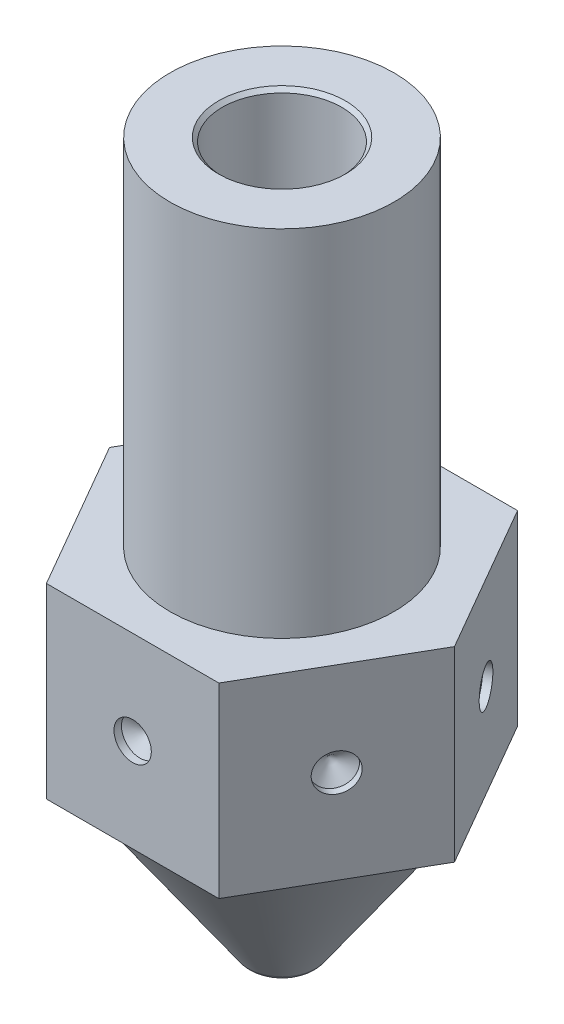
ISO-10303-21;
HEADER;
FILE_DESCRIPTION(('STEP AP214'),'2;1');
FILE_NAME('part.step','',(''),(''),'','','');
FILE_SCHEMA(('AUTOMOTIVE_DESIGN { 1 0 10303 214 1 1 1 1 }'));
ENDSEC;
DATA;
#1=APPLICATION_CONTEXT('core data for automotive mechanical design processes');
#2=APPLICATION_PROTOCOL_DEFINITION('international standard','automotive_design',2000,#1);
#3=PRODUCT_CONTEXT('',#1,'mechanical');
#4=PRODUCT('Part','Part','',(#3));
#5=PRODUCT_RELATED_PRODUCT_CATEGORY('part','',(#4));
#6=PRODUCT_DEFINITION_FORMATION('','',#4);
#7=PRODUCT_DEFINITION_CONTEXT('part definition',#1,'design');
#8=PRODUCT_DEFINITION('design','',#6,#7);
#9=PRODUCT_DEFINITION_SHAPE('','',#8);
#10=(LENGTH_UNIT() NAMED_UNIT(*) SI_UNIT(.MILLI.,.METRE.));
#11=(NAMED_UNIT(*) PLANE_ANGLE_UNIT() SI_UNIT($,.RADIAN.));
#12=(NAMED_UNIT(*) SI_UNIT($,.STERADIAN.) SOLID_ANGLE_UNIT());
#13=UNCERTAINTY_MEASURE_WITH_UNIT(LENGTH_MEASURE(1.E-05),#10,'distance_accuracy_value','');
#14=(GEOMETRIC_REPRESENTATION_CONTEXT(3) GLOBAL_UNCERTAINTY_ASSIGNED_CONTEXT((#13)) GLOBAL_UNIT_ASSIGNED_CONTEXT((#10,
#11,#12)) REPRESENTATION_CONTEXT('',''));
#15=CARTESIAN_POINT('',(0.,0.,0.));
#16=DIRECTION('',(0.,0.,1.));
#17=DIRECTION('',(1.,0.,0.));
#18=AXIS2_PLACEMENT_3D('',#15,#16,#17);
#19=CARTESIAN_POINT('',(3.9341607421644,4.5,0.));
#20=DIRECTION('',(0.,-1.,0.));
#21=DIRECTION('',(0.,0.,-1.));
#22=AXIS2_PLACEMENT_3D('',#19,#20,#21);
#23=PLANE('',#22);
#24=CARTESIAN_POINT('',(0.,4.5,0.));
#25=DIRECTION('',(0.,-1.,0.));
#26=DIRECTION('',(0.,0.,-1.));
#27=AXIS2_PLACEMENT_3D('',#24,#25,#26);
#28=CIRCLE('',#27,3.9341607421644);
#29=CARTESIAN_POINT('',(0.,4.5,-3.9341607421644));
#30=VERTEX_POINT('',#29);
#31=EDGE_CURVE('E228',#30,#30,#28,.T.);
#32=ORIENTED_EDGE('',*,*,#31,.F.);
#33=EDGE_LOOP('',(#32));
#34=FACE_BOUND('',#33,.T.);
#35=DIRECTION('',(1.,0.,0.));
#36=VECTOR('',#35,1.);
#37=CARTESIAN_POINT('',(3.9341607421644,4.5,-4.));
#38=LINE('',#37,#36);
#39=CARTESIAN_POINT('',(-2.3094010767585,4.5,-4.));
#40=VERTEX_POINT('',#39);
#41=CARTESIAN_POINT('',(2.3094010767585,4.5,-4.));
#42=VERTEX_POINT('',#41);
#43=EDGE_CURVE('E173',#40,#42,#38,.T.);
#44=ORIENTED_EDGE('',*,*,#43,.T.);
#45=DIRECTION('',(0.5,0.,0.866025403784438));
#46=VECTOR('',#45,1.);
#47=CARTESIAN_POINT('',(4.44764180067886,4.5,-0.296458427357094));
#48=LINE('',#47,#46);
#49=CARTESIAN_POINT('',(4.61880215351701,4.5,0.));
#50=VERTEX_POINT('',#49);
#51=EDGE_CURVE('E208',#42,#50,#48,.T.);
#52=ORIENTED_EDGE('',*,*,#51,.T.);
#53=DIRECTION('',(-0.5,0.,0.866025403784439));
#54=VECTOR('',#53,1.);
#55=CARTESIAN_POINT('',(4.44764180067886,4.5,0.296458427357093));
#56=LINE('',#55,#54);
#57=CARTESIAN_POINT('',(2.30940107675851,4.5,4.));
#58=VERTEX_POINT('',#57);
#59=EDGE_CURVE('E204',#50,#58,#56,.T.);
#60=ORIENTED_EDGE('',*,*,#59,.T.);
#61=DIRECTION('',(-1.,0.,0.));
#62=VECTOR('',#61,1.);
#63=CARTESIAN_POINT('',(3.9341607421644,4.5,4.));
#64=LINE('',#63,#62);
#65=CARTESIAN_POINT('',(-2.3094010767585,4.5,4.));
#66=VERTEX_POINT('',#65);
#67=EDGE_CURVE('E200',#58,#66,#64,.T.);
#68=ORIENTED_EDGE('',*,*,#67,.T.);
#69=DIRECTION('',(-0.500000000000001,0.,-0.866025403784438));
#70=VECTOR('',#69,1.);
#71=CARTESIAN_POINT('',(-2.48056142959665,4.5,3.70354157264291));
#72=LINE('',#71,#70);
#73=CARTESIAN_POINT('',(-4.61880215351701,4.5,0.));
#74=VERTEX_POINT('',#73);
#75=EDGE_CURVE('E196',#66,#74,#72,.T.);
#76=ORIENTED_EDGE('',*,*,#75,.T.);
#77=DIRECTION('',(0.5,0.,-0.866025403784439));
#78=VECTOR('',#77,1.);
#79=CARTESIAN_POINT('',(-2.48056142959665,4.5,-3.70354157264291));
#80=LINE('',#79,#78);
#81=EDGE_CURVE('E193',#74,#40,#80,.T.);
#82=ORIENTED_EDGE('',*,*,#81,.T.);
#83=EDGE_LOOP('',(#44,#52,#60,#68,#76,#82));
#84=FACE_BOUND('',#83,.T.);
#85=ADVANCED_FACE('F41',(#34,#84),#23,.T.);
#86=CARTESIAN_POINT('',(7.43519843321296,9.5,0.));
#87=DIRECTION('',(0.,1.,0.));
#88=DIRECTION('',(0.,0.,1.));
#89=AXIS2_PLACEMENT_3D('',#86,#87,#88);
#90=PLANE('',#89);
#91=CARTESIAN_POINT('',(0.,9.5,0.));
#92=DIRECTION('',(0.,-1.,0.));
#93=DIRECTION('',(0.,0.,-1.));
#94=AXIS2_PLACEMENT_3D('',#91,#92,#93);
#95=CIRCLE('',#94,3.);
#96=CARTESIAN_POINT('',(0.,9.5,-3.));
#97=VERTEX_POINT('',#96);
#98=EDGE_CURVE('E224',#97,#97,#95,.T.);
#99=ORIENTED_EDGE('',*,*,#98,.T.);
#100=EDGE_LOOP('',(#99));
#101=FACE_BOUND('',#100,.T.);
#102=DIRECTION('',(0.5,0.,-0.866025403784439));
#103=VECTOR('',#102,1.);
#104=CARTESIAN_POINT('',(5.32290122344099,9.5,-1.21953536267034));
#105=LINE('',#104,#103);
#106=CARTESIAN_POINT('',(2.30940107675851,9.5,4.));
#107=VERTEX_POINT('',#106);
#108=CARTESIAN_POINT('',(4.61880215351701,9.5,0.));
#109=VERTEX_POINT('',#108);
#110=EDGE_CURVE('E259',#107,#109,#105,.T.);
#111=ORIENTED_EDGE('',*,*,#110,.T.);
#112=DIRECTION('',(-0.5,0.,-0.866025403784438));
#113=VECTOR('',#112,1.);
#114=CARTESIAN_POINT('',(5.322901223441,9.5,1.21953536267034));
#115=LINE('',#114,#113);
#116=CARTESIAN_POINT('',(2.3094010767585,9.5,-4.));
#117=VERTEX_POINT('',#116);
#118=EDGE_CURVE('E263',#109,#117,#115,.T.);
#119=ORIENTED_EDGE('',*,*,#118,.T.);
#120=DIRECTION('',(-1.,0.,0.));
#121=VECTOR('',#120,1.);
#122=CARTESIAN_POINT('',(7.43519843321296,9.5,-4.));
#123=LINE('',#122,#121);
#124=CARTESIAN_POINT('',(-2.3094010767585,9.5,-4.));
#125=VERTEX_POINT('',#124);
#126=EDGE_CURVE('E243',#117,#125,#123,.T.);
#127=ORIENTED_EDGE('',*,*,#126,.T.);
#128=DIRECTION('',(-0.5,0.,0.866025403784439));
#129=VECTOR('',#128,1.);
#130=CARTESIAN_POINT('',(-1.60530200683451,9.5,-5.21953536267034));
#131=LINE('',#130,#129);
#132=CARTESIAN_POINT('',(-4.61880215351701,9.5,0.));
#133=VERTEX_POINT('',#132);
#134=EDGE_CURVE('E247',#125,#133,#131,.T.);
#135=ORIENTED_EDGE('',*,*,#134,.T.);
#136=DIRECTION('',(0.500000000000001,0.,0.866025403784438));
#137=VECTOR('',#136,1.);
#138=CARTESIAN_POINT('',(-1.60530200683451,9.5,5.21953536267035));
#139=LINE('',#138,#137);
#140=CARTESIAN_POINT('',(-2.3094010767585,9.5,4.));
#141=VERTEX_POINT('',#140);
#142=EDGE_CURVE('E251',#133,#141,#139,.T.);
#143=ORIENTED_EDGE('',*,*,#142,.T.);
#144=DIRECTION('',(1.,0.,0.));
#145=VECTOR('',#144,1.);
#146=CARTESIAN_POINT('',(7.43519843321297,9.5,4.));
#147=LINE('',#146,#145);
#148=EDGE_CURVE('E255',#141,#107,#147,.T.);
#149=ORIENTED_EDGE('',*,*,#148,.T.);
#150=EDGE_LOOP('',(#111,#119,#127,#135,#143,#149));
#151=FACE_BOUND('',#150,.T.);
#152=ADVANCED_FACE('F289',(#101,#151),#90,.T.);
#153=CARTESIAN_POINT('',(0.,0.,0.));
#154=DIRECTION('',(0.,-1.,0.));
#155=DIRECTION('',(0.,0.,-1.));
#156=AXIS2_PLACEMENT_3D('',#153,#154,#155);
#157=CYLINDRICAL_SURFACE('',#156,0.5);
#158=CARTESIAN_POINT('',(0.,0.,0.));
#159=DIRECTION('',(0.,-1.,0.));
#160=DIRECTION('',(0.,0.,-1.));
#161=AXIS2_PLACEMENT_3D('',#158,#159,#160);
#162=CIRCLE('',#161,0.5);
#163=CARTESIAN_POINT('',(0.,0.,-0.5));
#164=VERTEX_POINT('',#163);
#165=EDGE_CURVE('E239',#164,#164,#162,.T.);
#166=ORIENTED_EDGE('',*,*,#165,.T.);
#167=EDGE_LOOP('',(#166));
#168=FACE_BOUND('',#167,.T.);
#169=CARTESIAN_POINT('',(0.,2.,0.));
#170=DIRECTION('',(0.,-1.,0.));
#171=DIRECTION('',(0.,0.,-1.));
#172=AXIS2_PLACEMENT_3D('',#169,#170,#171);
#173=CIRCLE('',#172,0.5);
#174=CARTESIAN_POINT('',(0.,2.,-0.5));
#175=VERTEX_POINT('',#174);
#176=EDGE_CURVE('E212',#175,#175,#173,.T.);
#177=ORIENTED_EDGE('',*,*,#176,.F.);
#178=EDGE_LOOP('',(#177));
#179=FACE_BOUND('',#178,.T.);
#180=ADVANCED_FACE('F295',(#168,#179),#157,.F.);
#181=CARTESIAN_POINT('',(0.5,0.,0.));
#182=DIRECTION('',(0.,-1.,0.));
#183=DIRECTION('',(0.,0.,-1.));
#184=AXIS2_PLACEMENT_3D('',#181,#182,#183);
#185=PLANE('',#184);
#186=CARTESIAN_POINT('',(0.,0.,0.));
#187=DIRECTION('',(0.,-1.,0.));
#188=DIRECTION('',(0.,0.,-1.));
#189=AXIS2_PLACEMENT_3D('',#186,#187,#188);
#190=CIRCLE('',#189,0.575);
#191=CARTESIAN_POINT('',(0.,0.,-0.575));
#192=VERTEX_POINT('',#191);
#193=EDGE_CURVE('E235',#192,#192,#190,.T.);
#194=ORIENTED_EDGE('',*,*,#193,.T.);
#195=EDGE_LOOP('',(#194));
#196=FACE_BOUND('',#195,.T.);
#197=ORIENTED_EDGE('',*,*,#165,.F.);
#198=EDGE_LOOP('',(#197));
#199=FACE_BOUND('',#198,.T.);
#200=ADVANCED_FACE('F310',(#196,#199),#185,.T.);
#201=CARTESIAN_POINT('',(0.,0.4,0.));
#202=DIRECTION('',(0.,-1.,0.));
#203=DIRECTION('',(0.,0.,-1.));
#204=AXIS2_PLACEMENT_3D('',#201,#202,#203);
#205=TOROIDAL_SURFACE('',#204,0.575,0.4);
#206=CARTESIAN_POINT('',(0.,0.170569425459581,0.));
#207=DIRECTION('',(0.,-1.,0.));
#208=DIRECTION('',(0.,0.,-1.));
#209=AXIS2_PLACEMENT_3D('',#206,#207,#208);
#210=CIRCLE('',#209,0.902660817715596);
#211=CARTESIAN_POINT('',(0.,0.170569425459581,-0.902660817715596));
#212=VERTEX_POINT('',#211);
#213=EDGE_CURVE('E231',#212,#212,#210,.T.);
#214=ORIENTED_EDGE('',*,*,#213,.T.);
#215=EDGE_LOOP('',(#214));
#216=FACE_BOUND('',#215,.T.);
#217=ORIENTED_EDGE('',*,*,#193,.F.);
#218=EDGE_LOOP('',(#217));
#219=FACE_BOUND('',#218,.T.);
#220=ADVANCED_FACE('F306',(#216,#219),#205,.T.);
#221=CARTESIAN_POINT('',(0.,0.170569425459581,0.));
#222=DIRECTION('',(0.,1.,0.));
#223=DIRECTION('',(0.,0.,1.));
#224=AXIS2_PLACEMENT_3D('',#221,#222,#223);
#225=CONICAL_SURFACE('',#224,0.902660817715596,0.610865238198017);
#226=ORIENTED_EDGE('',*,*,#31,.T.);
#227=EDGE_LOOP('',(#226));
#228=FACE_BOUND('',#227,.T.);
#229=ORIENTED_EDGE('',*,*,#213,.F.);
#230=EDGE_LOOP('',(#229));
#231=FACE_BOUND('',#230,.T.);
#232=ADVANCED_FACE('F302',(#228,#231),#225,.T.);
#233=CARTESIAN_POINT('',(0.,0.,0.));
#234=DIRECTION('',(0.,-1.,0.));
#235=DIRECTION('',(0.,0.,-1.));
#236=AXIS2_PLACEMENT_3D('',#233,#234,#235);
#237=CYLINDRICAL_SURFACE('',#236,3.);
#238=CARTESIAN_POINT('',(0.,19.,0.));
#239=DIRECTION('',(0.,-1.,0.));
#240=DIRECTION('',(0.,0.,-1.));
#241=AXIS2_PLACEMENT_3D('',#238,#239,#240);
#242=CIRCLE('',#241,3.);
#243=CARTESIAN_POINT('',(0.,19.,-3.));
#244=VERTEX_POINT('',#243);
#245=EDGE_CURVE('E220',#244,#244,#242,.T.);
#246=ORIENTED_EDGE('',*,*,#245,.T.);
#247=EDGE_LOOP('',(#246));
#248=FACE_BOUND('',#247,.T.);
#249=ORIENTED_EDGE('',*,*,#98,.F.);
#250=EDGE_LOOP('',(#249));
#251=FACE_BOUND('',#250,.T.);
#252=ADVANCED_FACE('F305',(#248,#251),#237,.T.);
#253=CARTESIAN_POINT('',(3.,19.,0.));
#254=DIRECTION('',(0.,1.,0.));
#255=DIRECTION('',(0.,0.,1.));
#256=AXIS2_PLACEMENT_3D('',#253,#254,#255);
#257=PLANE('',#256);
#258=CARTESIAN_POINT('',(0.,19.,0.));
#259=DIRECTION('',(0.,1.,0.));
#260=DIRECTION('',(0.,0.,1.));
#261=AXIS2_PLACEMENT_3D('',#258,#259,#260);
#262=CIRCLE('',#261,1.7);
#263=CARTESIAN_POINT('',(0.,19.,1.7));
#264=VERTEX_POINT('',#263);
#265=EDGE_CURVE('E50',#264,#264,#262,.F.);
#266=ORIENTED_EDGE('',*,*,#265,.T.);
#267=EDGE_LOOP('',(#266));
#268=FACE_BOUND('',#267,.T.);
#269=ORIENTED_EDGE('',*,*,#245,.F.);
#270=EDGE_LOOP('',(#269));
#271=FACE_BOUND('',#270,.T.);
#272=ADVANCED_FACE('F270',(#268,#271),#257,.T.);
#273=CARTESIAN_POINT('',(0.,0.,0.));
#274=DIRECTION('',(0.,-1.,0.));
#275=DIRECTION('',(0.,0.,-1.));
#276=AXIS2_PLACEMENT_3D('',#273,#274,#275);
#277=CYLINDRICAL_SURFACE('',#276,1.6);
#278=CARTESIAN_POINT('',(0.,18.9,0.));
#279=DIRECTION('',(0.,1.,0.));
#280=DIRECTION('',(0.,0.,1.));
#281=AXIS2_PLACEMENT_3D('',#278,#279,#280);
#282=CIRCLE('',#281,1.6);
#283=CARTESIAN_POINT('',(0.,18.9,1.6));
#284=VERTEX_POINT('',#283);
#285=EDGE_CURVE('E12',#284,#284,#282,.T.);
#286=ORIENTED_EDGE('',*,*,#285,.T.);
#287=EDGE_LOOP('',(#286));
#288=FACE_BOUND('',#287,.T.);
#289=CARTESIAN_POINT('',(0.,3.57096280741632,0.));
#290=DIRECTION('',(0.,-1.,0.));
#291=DIRECTION('',(0.,0.,-1.));
#292=AXIS2_PLACEMENT_3D('',#289,#290,#291);
#293=CIRCLE('',#292,1.6);
#294=CARTESIAN_POINT('',(0.,3.57096280741632,-1.6));
#295=VERTEX_POINT('',#294);
#296=EDGE_CURVE('E216',#295,#295,#293,.T.);
#297=ORIENTED_EDGE('',*,*,#296,.T.);
#298=EDGE_LOOP('',(#297));
#299=FACE_BOUND('',#298,.T.);
#300=ADVANCED_FACE('F326',(#288,#299),#277,.F.);
#301=CARTESIAN_POINT('',(0.,3.57096280741632,0.));
#302=DIRECTION('',(0.,1.,0.));
#303=DIRECTION('',(0.,0.,1.));
#304=AXIS2_PLACEMENT_3D('',#301,#302,#303);
#305=CONICAL_SURFACE('',#304,1.6,0.610865238198017);
#306=ORIENTED_EDGE('',*,*,#176,.T.);
#307=EDGE_LOOP('',(#306));
#308=FACE_BOUND('',#307,.T.);
#309=ORIENTED_EDGE('',*,*,#296,.F.);
#310=EDGE_LOOP('',(#309));
#311=FACE_BOUND('',#310,.T.);
#312=ADVANCED_FACE('F322',(#308,#311),#305,.F.);
#313=CARTESIAN_POINT('',(4.61880215351701,3.5,0.));
#314=DIRECTION('',(0.866025403784438,0.,-0.5));
#315=DIRECTION('',(-0.5,0.,-0.866025403784438));
#316=AXIS2_PLACEMENT_3D('',#313,#314,#315);
#317=PLANE('',#316);
#318=CARTESIAN_POINT('',(3.46410161513776,7.,-2.));
#319=DIRECTION('',(0.866025403784438,0.,-0.5));
#320=DIRECTION('',(-0.5,0.,-0.866025403784438));
#321=AXIS2_PLACEMENT_3D('',#318,#319,#320);
#322=CIRCLE('',#321,0.49999999999999);
#323=CARTESIAN_POINT('',(3.21410161513776,7.,-2.43301270189221));
#324=VERTEX_POINT('',#323);
#325=EDGE_CURVE('E137',#324,#324,#322,.T.);
#326=ORIENTED_EDGE('',*,*,#325,.F.);
#327=EDGE_LOOP('',(#326));
#328=FACE_BOUND('',#327,.T.);
#329=DIRECTION('',(0.,1.,0.));
#330=VECTOR('',#329,1.);
#331=CARTESIAN_POINT('',(2.3094010767585,3.5,-4.));
#332=LINE('',#331,#330);
#333=EDGE_CURVE('E57',#42,#117,#332,.T.);
#334=ORIENTED_EDGE('',*,*,#333,.T.);
#335=ORIENTED_EDGE('',*,*,#118,.F.);
#336=DIRECTION('',(0.,1.,0.));
#337=VECTOR('',#336,1.);
#338=CARTESIAN_POINT('',(4.61880215351701,3.5,0.));
#339=LINE('',#338,#337);
#340=EDGE_CURVE('E169',#50,#109,#339,.T.);
#341=ORIENTED_EDGE('',*,*,#340,.F.);
#342=ORIENTED_EDGE('',*,*,#51,.F.);
#343=EDGE_LOOP('',(#334,#335,#341,#342));
#344=FACE_BOUND('',#343,.T.);
#345=ADVANCED_FACE('F325',(#328,#344),#317,.T.);
#346=CARTESIAN_POINT('',(2.30940107675851,3.5,4.));
#347=DIRECTION('',(0.866025403784439,0.,0.5));
#348=DIRECTION('',(0.5,0.,-0.866025403784439));
#349=AXIS2_PLACEMENT_3D('',#346,#347,#348);
#350=PLANE('',#349);
#351=CARTESIAN_POINT('',(3.46410161513776,7.,2.));
#352=DIRECTION('',(0.866025403784439,0.,0.5));
#353=DIRECTION('',(0.5,0.,-0.866025403784439));
#354=AXIS2_PLACEMENT_3D('',#351,#352,#353);
#355=CIRCLE('',#354,0.49999999999999);
#356=CARTESIAN_POINT('',(3.71410161513775,7.,1.56698729810779));
#357=VERTEX_POINT('',#356);
#358=EDGE_CURVE('E121',#357,#357,#355,.T.);
#359=ORIENTED_EDGE('',*,*,#358,.F.);
#360=EDGE_LOOP('',(#359));
#361=FACE_BOUND('',#360,.T.);
#362=ORIENTED_EDGE('',*,*,#340,.T.);
#363=ORIENTED_EDGE('',*,*,#110,.F.);
#364=DIRECTION('',(0.,1.,0.));
#365=VECTOR('',#364,1.);
#366=CARTESIAN_POINT('',(2.30940107675851,3.5,4.));
#367=LINE('',#366,#365);
#368=EDGE_CURVE('E174',#58,#107,#367,.T.);
#369=ORIENTED_EDGE('',*,*,#368,.F.);
#370=ORIENTED_EDGE('',*,*,#59,.F.);
#371=EDGE_LOOP('',(#362,#363,#369,#370));
#372=FACE_BOUND('',#371,.T.);
#373=ADVANCED_FACE('F348',(#361,#372),#350,.T.);
#374=CARTESIAN_POINT('',(-2.3094010767585,3.5,4.));
#375=DIRECTION('',(0.,0.,1.));
#376=DIRECTION('',(1.,0.,0.));
#377=AXIS2_PLACEMENT_3D('',#374,#375,#376);
#378=PLANE('',#377);
#379=CARTESIAN_POINT('',(0.,7.,4.));
#380=DIRECTION('',(0.,0.,1.));
#381=DIRECTION('',(1.,0.,0.));
#382=AXIS2_PLACEMENT_3D('',#379,#380,#381);
#383=CIRCLE('',#382,0.49999999999999);
#384=CARTESIAN_POINT('',(0.499999999999993,7.,4.));
#385=VERTEX_POINT('',#384);
#386=EDGE_CURVE('E122',#385,#385,#383,.T.);
#387=ORIENTED_EDGE('',*,*,#386,.F.);
#388=EDGE_LOOP('',(#387));
#389=FACE_BOUND('',#388,.T.);
#390=ORIENTED_EDGE('',*,*,#368,.T.);
#391=ORIENTED_EDGE('',*,*,#148,.F.);
#392=DIRECTION('',(0.,1.,0.));
#393=VECTOR('',#392,1.);
#394=CARTESIAN_POINT('',(-2.3094010767585,3.5,4.));
#395=LINE('',#394,#393);
#396=EDGE_CURVE('E178',#66,#141,#395,.T.);
#397=ORIENTED_EDGE('',*,*,#396,.F.);
#398=ORIENTED_EDGE('',*,*,#67,.F.);
#399=EDGE_LOOP('',(#390,#391,#397,#398));
#400=FACE_BOUND('',#399,.T.);
#401=ADVANCED_FACE('F351',(#389,#400),#378,.T.);
#402=CARTESIAN_POINT('',(-4.61880215351701,3.5,0.));
#403=DIRECTION('',(-0.866025403784438,0.,0.500000000000001));
#404=DIRECTION('',(0.500000000000001,0.,0.866025403784438));
#405=AXIS2_PLACEMENT_3D('',#402,#403,#404);
#406=PLANE('',#405);
#407=CARTESIAN_POINT('',(-3.46410161513775,7.,2.));
#408=DIRECTION('',(-0.866025403784438,0.,0.500000000000001));
#409=DIRECTION('',(0.500000000000001,0.,0.866025403784438));
#410=AXIS2_PLACEMENT_3D('',#407,#408,#409);
#411=CIRCLE('',#410,0.49999999999999);
#412=CARTESIAN_POINT('',(-3.21410161513776,7.,2.43301270189222));
#413=VERTEX_POINT('',#412);
#414=EDGE_CURVE('E161',#413,#413,#411,.T.);
#415=ORIENTED_EDGE('',*,*,#414,.F.);
#416=EDGE_LOOP('',(#415));
#417=FACE_BOUND('',#416,.T.);
#418=ORIENTED_EDGE('',*,*,#396,.T.);
#419=ORIENTED_EDGE('',*,*,#142,.F.);
#420=DIRECTION('',(0.,1.,0.));
#421=VECTOR('',#420,1.);
#422=CARTESIAN_POINT('',(-4.61880215351701,3.5,0.));
#423=LINE('',#422,#421);
#424=EDGE_CURVE('E182',#74,#133,#423,.T.);
#425=ORIENTED_EDGE('',*,*,#424,.F.);
#426=ORIENTED_EDGE('',*,*,#75,.F.);
#427=EDGE_LOOP('',(#418,#419,#425,#426));
#428=FACE_BOUND('',#427,.T.);
#429=ADVANCED_FACE('F357',(#417,#428),#406,.T.);
#430=CARTESIAN_POINT('',(-2.3094010767585,3.5,-4.));
#431=DIRECTION('',(-0.866025403784438,0.,-0.5));
#432=DIRECTION('',(-0.5,0.,0.866025403784439));
#433=AXIS2_PLACEMENT_3D('',#430,#431,#432);
#434=PLANE('',#433);
#435=CARTESIAN_POINT('',(-3.46410161513775,7.,-2.));
#436=DIRECTION('',(-0.866025403784439,0.,-0.5));
#437=DIRECTION('',(-0.5,0.,0.866025403784439));
#438=AXIS2_PLACEMENT_3D('',#435,#436,#437);
#439=CIRCLE('',#438,0.49999999999999);
#440=CARTESIAN_POINT('',(-3.71410161513775,7.,-1.56698729810779));
#441=VERTEX_POINT('',#440);
#442=EDGE_CURVE('E153',#441,#441,#439,.T.);
#443=ORIENTED_EDGE('',*,*,#442,.F.);
#444=EDGE_LOOP('',(#443));
#445=FACE_BOUND('',#444,.T.);
#446=ORIENTED_EDGE('',*,*,#424,.T.);
#447=ORIENTED_EDGE('',*,*,#134,.F.);
#448=DIRECTION('',(0.,1.,0.));
#449=VECTOR('',#448,1.);
#450=CARTESIAN_POINT('',(-2.3094010767585,3.5,-4.));
#451=LINE('',#450,#449);
#452=EDGE_CURVE('E62',#40,#125,#451,.T.);
#453=ORIENTED_EDGE('',*,*,#452,.F.);
#454=ORIENTED_EDGE('',*,*,#81,.F.);
#455=EDGE_LOOP('',(#446,#447,#453,#454));
#456=FACE_BOUND('',#455,.T.);
#457=ADVANCED_FACE('F284',(#445,#456),#434,.T.);
#458=CARTESIAN_POINT('',(2.3094010767585,3.5,-4.));
#459=DIRECTION('',(0.,0.,-1.));
#460=DIRECTION('',(-1.,0.,0.));
#461=AXIS2_PLACEMENT_3D('',#458,#459,#460);
#462=PLANE('',#461);
#463=CARTESIAN_POINT('',(0.,7.,-4.));
#464=DIRECTION('',(0.,0.,-1.));
#465=DIRECTION('',(-1.,0.,0.));
#466=AXIS2_PLACEMENT_3D('',#463,#464,#465);
#467=CIRCLE('',#466,0.49999999999999);
#468=CARTESIAN_POINT('',(-0.499999999999988,7.,-4.));
#469=VERTEX_POINT('',#468);
#470=EDGE_CURVE('E145',#469,#469,#467,.T.);
#471=ORIENTED_EDGE('',*,*,#470,.F.);
#472=EDGE_LOOP('',(#471));
#473=FACE_BOUND('',#472,.T.);
#474=ORIENTED_EDGE('',*,*,#452,.T.);
#475=ORIENTED_EDGE('',*,*,#126,.F.);
#476=ORIENTED_EDGE('',*,*,#333,.F.);
#477=ORIENTED_EDGE('',*,*,#43,.F.);
#478=EDGE_LOOP('',(#474,#475,#476,#477));
#479=FACE_BOUND('',#478,.T.);
#480=ADVANCED_FACE('F275',(#473,#479),#462,.T.);
#481=CARTESIAN_POINT('',(0.,19.,0.));
#482=DIRECTION('',(0.,1.,0.));
#483=DIRECTION('',(0.,0.,1.));
#484=AXIS2_PLACEMENT_3D('',#481,#482,#483);
#485=CONICAL_SURFACE('',#484,1.7,0.785398163397456);
#486=ORIENTED_EDGE('',*,*,#285,.F.);
#487=EDGE_LOOP('',(#486));
#488=FACE_BOUND('',#487,.T.);
#489=ORIENTED_EDGE('',*,*,#265,.F.);
#490=EDGE_LOOP('',(#489));
#491=FACE_BOUND('',#490,.T.);
#492=ADVANCED_FACE('F43',(#488,#491),#485,.F.);
#493=CARTESIAN_POINT('',(-3.29089653438087,7.,1.90000000000001));
#494=DIRECTION('',(-0.866025403784438,0.,0.500000000000001));
#495=DIRECTION('',(0.500000000000001,0.,0.866025403784438));
#496=AXIS2_PLACEMENT_3D('',#493,#494,#495);
#497=CONICAL_SURFACE('',#496,0.49999999999999,1.02974425867663);
#498=CARTESIAN_POINT('',(-3.03071625427511,7.,1.74978484524311));
#499=VERTEX_POINT('',#498);
#500=VERTEX_LOOP('',#499);
#501=FACE_BOUND('',#500,.T.);
#502=CARTESIAN_POINT('',(-3.29089653438087,7.,1.90000000000001));
#503=DIRECTION('',(-0.866025403784438,0.,0.500000000000001));
#504=DIRECTION('',(0.500000000000001,0.,0.866025403784438));
#505=AXIS2_PLACEMENT_3D('',#502,#503,#504);
#506=CIRCLE('',#505,0.49999999999999);
#507=CARTESIAN_POINT('',(-3.04089653438088,7.,2.33301270189222));
#508=VERTEX_POINT('',#507);
#509=EDGE_CURVE('E165',#508,#508,#506,.T.);
#510=ORIENTED_EDGE('',*,*,#509,.T.);
#511=EDGE_LOOP('',(#510));
#512=FACE_BOUND('',#511,.T.);
#513=ADVANCED_FACE('F274',(#501,#512),#497,.F.);
#514=CARTESIAN_POINT('',(-3.46410161513775,7.,2.));
#515=DIRECTION('',(-0.866025403784438,0.,0.500000000000001));
#516=DIRECTION('',(0.500000000000001,0.,0.866025403784438));
#517=AXIS2_PLACEMENT_3D('',#514,#515,#516);
#518=CYLINDRICAL_SURFACE('',#517,0.49999999999999);
#519=ORIENTED_EDGE('',*,*,#509,.F.);
#520=EDGE_LOOP('',(#519));
#521=FACE_BOUND('',#520,.T.);
#522=ORIENTED_EDGE('',*,*,#414,.T.);
#523=EDGE_LOOP('',(#522));
#524=FACE_BOUND('',#523,.T.);
#525=ADVANCED_FACE('F281',(#521,#524),#518,.F.);
#526=CARTESIAN_POINT('',(-3.29089653438087,7.,-1.90000000000001));
#527=DIRECTION('',(-0.866025403784439,0.,-0.5));
#528=DIRECTION('',(-0.5,0.,0.866025403784439));
#529=AXIS2_PLACEMENT_3D('',#526,#527,#528);
#530=CONICAL_SURFACE('',#529,0.49999999999999,1.02974425867663);
#531=CARTESIAN_POINT('',(-3.03071625427511,7.,-1.74978484524311));
#532=VERTEX_POINT('',#531);
#533=VERTEX_LOOP('',#532);
#534=FACE_BOUND('',#533,.T.);
#535=CARTESIAN_POINT('',(-3.29089653438087,7.,-1.90000000000001));
#536=DIRECTION('',(-0.866025403784439,0.,-0.5));
#537=DIRECTION('',(-0.5,0.,0.866025403784439));
#538=AXIS2_PLACEMENT_3D('',#535,#536,#537);
#539=CIRCLE('',#538,0.49999999999999);
#540=CARTESIAN_POINT('',(-3.54089653438087,7.,-1.4669872981078));
#541=VERTEX_POINT('',#540);
#542=EDGE_CURVE('E157',#541,#541,#539,.T.);
#543=ORIENTED_EDGE('',*,*,#542,.T.);
#544=EDGE_LOOP('',(#543));
#545=FACE_BOUND('',#544,.T.);
#546=ADVANCED_FACE('F407',(#534,#545),#530,.F.);
#547=CARTESIAN_POINT('',(-3.46410161513775,7.,-2.));
#548=DIRECTION('',(-0.866025403784439,0.,-0.5));
#549=DIRECTION('',(-0.5,0.,0.866025403784439));
#550=AXIS2_PLACEMENT_3D('',#547,#548,#549);
#551=CYLINDRICAL_SURFACE('',#550,0.49999999999999);
#552=ORIENTED_EDGE('',*,*,#542,.F.);
#553=EDGE_LOOP('',(#552));
#554=FACE_BOUND('',#553,.T.);
#555=ORIENTED_EDGE('',*,*,#442,.T.);
#556=EDGE_LOOP('',(#555));
#557=FACE_BOUND('',#556,.T.);
#558=ADVANCED_FACE('F403',(#554,#557),#551,.F.);
#559=CARTESIAN_POINT('',(0.,7.,-3.80000000000001));
#560=DIRECTION('',(0.,0.,-1.));
#561=DIRECTION('',(-1.,0.,0.));
#562=AXIS2_PLACEMENT_3D('',#559,#560,#561);
#563=CONICAL_SURFACE('',#562,0.49999999999999,1.02974425867663);
#564=CARTESIAN_POINT('',(0.,7.,-3.49956969048622));
#565=VERTEX_POINT('',#564);
#566=VERTEX_LOOP('',#565);
#567=FACE_BOUND('',#566,.T.);
#568=CARTESIAN_POINT('',(0.,7.,-3.80000000000001));
#569=DIRECTION('',(0.,0.,-1.));
#570=DIRECTION('',(-1.,0.,0.));
#571=AXIS2_PLACEMENT_3D('',#568,#569,#570);
#572=CIRCLE('',#571,0.49999999999999);
#573=CARTESIAN_POINT('',(-0.499999999999988,7.,-3.80000000000001));
#574=VERTEX_POINT('',#573);
#575=EDGE_CURVE('E149',#574,#574,#572,.T.);
#576=ORIENTED_EDGE('',*,*,#575,.T.);
#577=EDGE_LOOP('',(#576));
#578=FACE_BOUND('',#577,.T.);
#579=ADVANCED_FACE('F399',(#567,#578),#563,.F.);
#580=CARTESIAN_POINT('',(0.,7.,-4.));
#581=DIRECTION('',(0.,0.,-1.));
#582=DIRECTION('',(-1.,0.,0.));
#583=AXIS2_PLACEMENT_3D('',#580,#581,#582);
#584=CYLINDRICAL_SURFACE('',#583,0.49999999999999);
#585=ORIENTED_EDGE('',*,*,#575,.F.);
#586=EDGE_LOOP('',(#585));
#587=FACE_BOUND('',#586,.T.);
#588=ORIENTED_EDGE('',*,*,#470,.T.);
#589=EDGE_LOOP('',(#588));
#590=FACE_BOUND('',#589,.T.);
#591=ADVANCED_FACE('F391',(#587,#590),#584,.F.);
#592=CARTESIAN_POINT('',(3.29089653438087,7.,-1.9));
#593=DIRECTION('',(0.866025403784438,0.,-0.5));
#594=DIRECTION('',(-0.5,0.,-0.866025403784438));
#595=AXIS2_PLACEMENT_3D('',#592,#593,#594);
#596=CONICAL_SURFACE('',#595,0.49999999999999,1.02974425867663);
#597=CARTESIAN_POINT('',(3.03071625427511,7.,-1.74978484524311));
#598=VERTEX_POINT('',#597);
#599=VERTEX_LOOP('',#598);
#600=FACE_BOUND('',#599,.T.);
#601=CARTESIAN_POINT('',(3.29089653438087,7.,-1.9));
#602=DIRECTION('',(0.866025403784438,0.,-0.5));
#603=DIRECTION('',(-0.5,0.,-0.866025403784438));
#604=AXIS2_PLACEMENT_3D('',#601,#602,#603);
#605=CIRCLE('',#604,0.49999999999999);
#606=CARTESIAN_POINT('',(3.04089653438088,7.,-2.33301270189222));
#607=VERTEX_POINT('',#606);
#608=EDGE_CURVE('E141',#607,#607,#605,.T.);
#609=ORIENTED_EDGE('',*,*,#608,.T.);
#610=EDGE_LOOP('',(#609));
#611=FACE_BOUND('',#610,.T.);
#612=ADVANCED_FACE('F382',(#600,#611),#596,.F.);
#613=CARTESIAN_POINT('',(3.46410161513775,7.,-2.));
#614=DIRECTION('',(0.866025403784438,0.,-0.5));
#615=DIRECTION('',(-0.5,0.,-0.866025403784438));
#616=AXIS2_PLACEMENT_3D('',#613,#614,#615);
#617=CYLINDRICAL_SURFACE('',#616,0.49999999999999);
#618=ORIENTED_EDGE('',*,*,#608,.F.);
#619=EDGE_LOOP('',(#618));
#620=FACE_BOUND('',#619,.T.);
#621=ORIENTED_EDGE('',*,*,#325,.T.);
#622=EDGE_LOOP('',(#621));
#623=FACE_BOUND('',#622,.T.);
#624=ADVANCED_FACE('F379',(#620,#623),#617,.F.);
#625=CARTESIAN_POINT('',(3.29089653438088,7.,1.9));
#626=DIRECTION('',(0.866025403784439,0.,0.5));
#627=DIRECTION('',(0.5,0.,-0.866025403784439));
#628=AXIS2_PLACEMENT_3D('',#625,#626,#627);
#629=CONICAL_SURFACE('',#628,0.49999999999999,1.02974425867663);
#630=CARTESIAN_POINT('',(3.03071625427511,7.,1.74978484524311));
#631=VERTEX_POINT('',#630);
#632=VERTEX_LOOP('',#631);
#633=FACE_BOUND('',#632,.T.);
#634=CARTESIAN_POINT('',(3.29089653438088,7.,1.9));
#635=DIRECTION('',(0.866025403784439,0.,0.5));
#636=DIRECTION('',(0.5,0.,-0.866025403784439));
#637=AXIS2_PLACEMENT_3D('',#634,#635,#636);
#638=CIRCLE('',#637,0.49999999999999);
#639=CARTESIAN_POINT('',(3.54089653438087,7.,1.46698729810779));
#640=VERTEX_POINT('',#639);
#641=EDGE_CURVE('E128',#640,#640,#638,.T.);
#642=ORIENTED_EDGE('',*,*,#641,.T.);
#643=EDGE_LOOP('',(#642));
#644=FACE_BOUND('',#643,.T.);
#645=ADVANCED_FACE('F381',(#633,#644),#629,.F.);
#646=CARTESIAN_POINT('',(3.46410161513776,7.,2.));
#647=DIRECTION('',(0.866025403784439,0.,0.5));
#648=DIRECTION('',(0.5,0.,-0.866025403784439));
#649=AXIS2_PLACEMENT_3D('',#646,#647,#648);
#650=CYLINDRICAL_SURFACE('',#649,0.49999999999999);
#651=ORIENTED_EDGE('',*,*,#641,.F.);
#652=EDGE_LOOP('',(#651));
#653=FACE_BOUND('',#652,.T.);
#654=ORIENTED_EDGE('',*,*,#358,.T.);
#655=EDGE_LOOP('',(#654));
#656=FACE_BOUND('',#655,.T.);
#657=ADVANCED_FACE('F114',(#653,#656),#650,.F.);
#658=CARTESIAN_POINT('',(0.,7.,3.80000000000001));
#659=DIRECTION('',(0.,0.,1.));
#660=DIRECTION('',(1.,0.,0.));
#661=AXIS2_PLACEMENT_3D('',#658,#659,#660);
#662=CONICAL_SURFACE('',#661,0.49999999999999,1.02974425867663);
#663=CARTESIAN_POINT('',(0.,7.,3.49956969048622));
#664=VERTEX_POINT('',#663);
#665=VERTEX_LOOP('',#664);
#666=FACE_BOUND('',#665,.T.);
#667=CARTESIAN_POINT('',(0.,7.,3.80000000000001));
#668=DIRECTION('',(0.,0.,1.));
#669=DIRECTION('',(1.,0.,0.));
#670=AXIS2_PLACEMENT_3D('',#667,#668,#669);
#671=CIRCLE('',#670,0.49999999999999);
#672=CARTESIAN_POINT('',(0.499999999999993,7.,3.80000000000001));
#673=VERTEX_POINT('',#672);
#674=EDGE_CURVE('E118',#673,#673,#671,.T.);
#675=ORIENTED_EDGE('',*,*,#674,.T.);
#676=EDGE_LOOP('',(#675));
#677=FACE_BOUND('',#676,.T.);
#678=ADVANCED_FACE('F110',(#666,#677),#662,.F.);
#679=CARTESIAN_POINT('',(0.,7.,4.));
#680=DIRECTION('',(0.,0.,1.));
#681=DIRECTION('',(1.,0.,0.));
#682=AXIS2_PLACEMENT_3D('',#679,#680,#681);
#683=CYLINDRICAL_SURFACE('',#682,0.49999999999999);
#684=ORIENTED_EDGE('',*,*,#674,.F.);
#685=EDGE_LOOP('',(#684));
#686=FACE_BOUND('',#685,.T.);
#687=ORIENTED_EDGE('',*,*,#386,.T.);
#688=EDGE_LOOP('',(#687));
#689=FACE_BOUND('',#688,.T.);
#690=ADVANCED_FACE('F113',(#686,#689),#683,.F.);
#691=CLOSED_SHELL('',(#85,#152,#180,#200,#220,#232,#252,#272,#300,#312,#345,#373,#401,#429,#457,
#480,#492,#513,#525,#546,#558,#579,#591,#612,#624,#645,#657,#678,#690));
#692=MANIFOLD_SOLID_BREP('B2',#691);
#693=ADVANCED_BREP_SHAPE_REPRESENTATION('',(#18,#692),#14);
#694=SHAPE_DEFINITION_REPRESENTATION(#9,#693);
ENDSEC;
END-ISO-10303-21;
